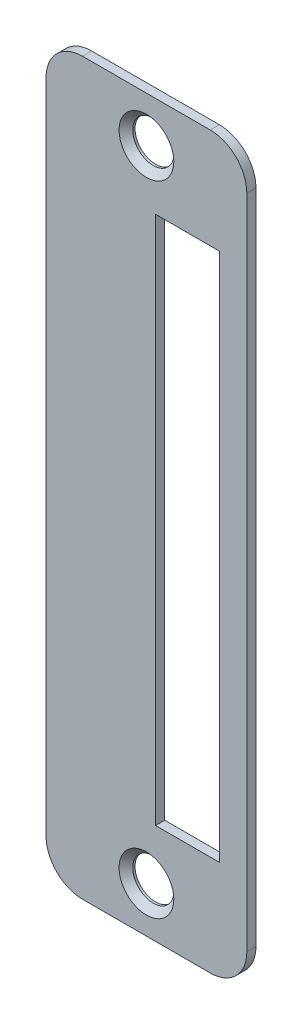
ISO-10303-21;
HEADER;
FILE_DESCRIPTION(('STEP AP214'),'2;1');
FILE_NAME('part.step','',(''),(''),'','','');
FILE_SCHEMA(('AUTOMOTIVE_DESIGN { 1 0 10303 214 1 1 1 1 }'));
ENDSEC;
DATA;
#1=APPLICATION_CONTEXT('core data for automotive mechanical design processes');
#2=APPLICATION_PROTOCOL_DEFINITION('international standard','automotive_design',2000,#1);
#3=PRODUCT_CONTEXT('',#1,'mechanical');
#4=PRODUCT('Part','Part','',(#3));
#5=PRODUCT_RELATED_PRODUCT_CATEGORY('part','',(#4));
#6=PRODUCT_DEFINITION_FORMATION('','',#4);
#7=PRODUCT_DEFINITION_CONTEXT('part definition',#1,'design');
#8=PRODUCT_DEFINITION('design','',#6,#7);
#9=PRODUCT_DEFINITION_SHAPE('','',#8);
#10=(LENGTH_UNIT() NAMED_UNIT(*) SI_UNIT(.MILLI.,.METRE.));
#11=(NAMED_UNIT(*) PLANE_ANGLE_UNIT() SI_UNIT($,.RADIAN.));
#12=(NAMED_UNIT(*) SI_UNIT($,.STERADIAN.) SOLID_ANGLE_UNIT());
#13=UNCERTAINTY_MEASURE_WITH_UNIT(LENGTH_MEASURE(1.E-05),#10,'distance_accuracy_value','');
#14=(GEOMETRIC_REPRESENTATION_CONTEXT(3) GLOBAL_UNCERTAINTY_ASSIGNED_CONTEXT((#13)) GLOBAL_UNIT_ASSIGNED_CONTEXT((#10,
#11,#12)) REPRESENTATION_CONTEXT('',''));
#15=CARTESIAN_POINT('',(0.,0.,0.));
#16=DIRECTION('',(0.,0.,1.));
#17=DIRECTION('',(1.,0.,0.));
#18=AXIS2_PLACEMENT_3D('',#15,#16,#17);
#19=CARTESIAN_POINT('',(-7.,-36.,1.));
#20=DIRECTION('',(0.,0.,-1.));
#21=DIRECTION('',(-1.,0.,0.));
#22=AXIS2_PLACEMENT_3D('',#19,#20,#21);
#23=PLANE('',#22);
#24=CARTESIAN_POINT('',(0.,-35.,1.));
#25=DIRECTION('',(0.,0.,1.));
#26=DIRECTION('',(1.,0.,0.));
#27=AXIS2_PLACEMENT_3D('',#24,#25,#26);
#28=CIRCLE('',#27,3.);
#29=CARTESIAN_POINT('',(3.00000000000001,-35.,1.));
#30=VERTEX_POINT('',#29);
#31=EDGE_CURVE('E319',#30,#30,#28,.T.);
#32=ORIENTED_EDGE('',*,*,#31,.F.);
#33=EDGE_LOOP('',(#32));
#34=FACE_BOUND('',#33,.T.);
#35=CARTESIAN_POINT('',(-7.,-36.,1.));
#36=DIRECTION('',(0.,0.,1.));
#37=DIRECTION('',(-1.,0.,0.));
#38=AXIS2_PLACEMENT_3D('',#35,#36,#37);
#39=CIRCLE('',#38,4.);
#40=CARTESIAN_POINT('',(-11.,-36.,1.));
#41=VERTEX_POINT('',#40);
#42=CARTESIAN_POINT('',(-6.99999999999997,-40.,1.));
#43=VERTEX_POINT('',#42);
#44=EDGE_CURVE('E160',#41,#43,#39,.T.);
#45=ORIENTED_EDGE('',*,*,#44,.T.);
#46=DIRECTION('',(1.,0.,0.));
#47=VECTOR('',#46,1.);
#48=CARTESIAN_POINT('',(-6.99999999999997,-40.,1.));
#49=LINE('',#48,#47);
#50=CARTESIAN_POINT('',(6.99999999999997,-40.,1.));
#51=VERTEX_POINT('',#50);
#52=EDGE_CURVE('E163',#43,#51,#49,.T.);
#53=ORIENTED_EDGE('',*,*,#52,.T.);
#54=CARTESIAN_POINT('',(7.,-36.,1.));
#55=DIRECTION('',(0.,0.,1.));
#56=DIRECTION('',(-1.,0.,0.));
#57=AXIS2_PLACEMENT_3D('',#54,#55,#56);
#58=CIRCLE('',#57,4.);
#59=CARTESIAN_POINT('',(11.,-36.,1.));
#60=VERTEX_POINT('',#59);
#61=EDGE_CURVE('E166',#51,#60,#58,.T.);
#62=ORIENTED_EDGE('',*,*,#61,.T.);
#63=DIRECTION('',(0.,1.,0.));
#64=VECTOR('',#63,1.);
#65=CARTESIAN_POINT('',(11.,-36.,1.));
#66=LINE('',#65,#64);
#67=CARTESIAN_POINT('',(11.,36.,1.));
#68=VERTEX_POINT('',#67);
#69=EDGE_CURVE('E168',#60,#68,#66,.T.);
#70=ORIENTED_EDGE('',*,*,#69,.T.);
#71=CARTESIAN_POINT('',(7.,36.,1.));
#72=DIRECTION('',(0.,0.,1.));
#73=DIRECTION('',(1.,0.,0.));
#74=AXIS2_PLACEMENT_3D('',#71,#72,#73);
#75=CIRCLE('',#74,4.);
#76=CARTESIAN_POINT('',(6.99999999999997,40.,1.));
#77=VERTEX_POINT('',#76);
#78=EDGE_CURVE('E170',#68,#77,#75,.T.);
#79=ORIENTED_EDGE('',*,*,#78,.T.);
#80=DIRECTION('',(-1.,0.,0.));
#81=VECTOR('',#80,1.);
#82=CARTESIAN_POINT('',(6.99999999999997,40.,1.));
#83=LINE('',#82,#81);
#84=CARTESIAN_POINT('',(-6.99999999999997,40.,1.));
#85=VERTEX_POINT('',#84);
#86=EDGE_CURVE('E172',#77,#85,#83,.T.);
#87=ORIENTED_EDGE('',*,*,#86,.T.);
#88=CARTESIAN_POINT('',(-7.,36.,1.));
#89=DIRECTION('',(0.,0.,1.));
#90=DIRECTION('',(1.,0.,0.));
#91=AXIS2_PLACEMENT_3D('',#88,#89,#90);
#92=CIRCLE('',#91,4.);
#93=CARTESIAN_POINT('',(-11.,36.,1.));
#94=VERTEX_POINT('',#93);
#95=EDGE_CURVE('E174',#85,#94,#92,.T.);
#96=ORIENTED_EDGE('',*,*,#95,.T.);
#97=DIRECTION('',(0.,-1.,0.));
#98=VECTOR('',#97,1.);
#99=CARTESIAN_POINT('',(-11.,36.,1.));
#100=LINE('',#99,#98);
#101=EDGE_CURVE('E176',#94,#41,#100,.T.);
#102=ORIENTED_EDGE('',*,*,#101,.T.);
#103=EDGE_LOOP('',(#45,#53,#62,#70,#79,#87,#96,#102));
#104=FACE_BOUND('',#103,.T.);
#105=DIRECTION('',(-1.,0.,0.));
#106=VECTOR('',#105,1.);
#107=CARTESIAN_POINT('',(8.00000000000001,29.,1.));
#108=LINE('',#107,#106);
#109=CARTESIAN_POINT('',(8.00000000000001,29.,1.));
#110=VERTEX_POINT('',#109);
#111=CARTESIAN_POINT('',(1.00000000000001,29.,1.));
#112=VERTEX_POINT('',#111);
#113=EDGE_CURVE('E121',#110,#112,#108,.T.);
#114=ORIENTED_EDGE('',*,*,#113,.F.);
#115=DIRECTION('',(0.,1.,0.));
#116=VECTOR('',#115,1.);
#117=CARTESIAN_POINT('',(8.00000000000001,-29.,1.));
#118=LINE('',#117,#116);
#119=CARTESIAN_POINT('',(8.00000000000001,-29.,1.));
#120=VERTEX_POINT('',#119);
#121=EDGE_CURVE('E144',#120,#110,#118,.T.);
#122=ORIENTED_EDGE('',*,*,#121,.F.);
#123=DIRECTION('',(1.,0.,0.));
#124=VECTOR('',#123,1.);
#125=CARTESIAN_POINT('',(8.00000000000001,-29.,1.));
#126=LINE('',#125,#124);
#127=CARTESIAN_POINT('',(1.00000000000002,-29.,1.));
#128=VERTEX_POINT('',#127);
#129=EDGE_CURVE('E142',#128,#120,#126,.T.);
#130=ORIENTED_EDGE('',*,*,#129,.F.);
#131=DIRECTION('',(0.,-1.,0.));
#132=VECTOR('',#131,1.);
#133=CARTESIAN_POINT('',(1.00000000000001,29.,1.));
#134=LINE('',#133,#132);
#135=EDGE_CURVE('E129',#112,#128,#134,.T.);
#136=ORIENTED_EDGE('',*,*,#135,.F.);
#137=EDGE_LOOP('',(#114,#122,#130,#136));
#138=FACE_BOUND('',#137,.T.);
#139=CARTESIAN_POINT('',(0.,35.,1.));
#140=DIRECTION('',(0.,0.,1.));
#141=DIRECTION('',(1.,0.,0.));
#142=AXIS2_PLACEMENT_3D('',#139,#140,#141);
#143=CIRCLE('',#142,3.);
#144=CARTESIAN_POINT('',(3.,35.,1.));
#145=VERTEX_POINT('',#144);
#146=EDGE_CURVE('E312',#145,#145,#143,.T.);
#147=ORIENTED_EDGE('',*,*,#146,.F.);
#148=EDGE_LOOP('',(#147));
#149=FACE_BOUND('',#148,.T.);
#150=ADVANCED_FACE('F32',(#34,#104,#138,#149),#23,.F.);
#151=CARTESIAN_POINT('',(-7.,-36.,0.));
#152=DIRECTION('',(0.,0.,-1.));
#153=DIRECTION('',(-1.,0.,0.));
#154=AXIS2_PLACEMENT_3D('',#151,#152,#153);
#155=PLANE('',#154);
#156=CARTESIAN_POINT('',(0.,35.,0.));
#157=DIRECTION('',(0.,0.,1.));
#158=DIRECTION('',(1.,0.,0.));
#159=AXIS2_PLACEMENT_3D('',#156,#157,#158);
#160=CIRCLE('',#159,2.25);
#161=CARTESIAN_POINT('',(2.25,35.,0.));
#162=VERTEX_POINT('',#161);
#163=EDGE_CURVE('E314',#162,#162,#160,.T.);
#164=ORIENTED_EDGE('',*,*,#163,.T.);
#165=EDGE_LOOP('',(#164));
#166=FACE_BOUND('',#165,.T.);
#167=DIRECTION('',(0.,1.,0.));
#168=VECTOR('',#167,1.);
#169=CARTESIAN_POINT('',(8.00000000000001,-29.,0.));
#170=LINE('',#169,#168);
#171=CARTESIAN_POINT('',(8.00000000000001,-29.,0.));
#172=VERTEX_POINT('',#171);
#173=CARTESIAN_POINT('',(8.00000000000001,29.,0.));
#174=VERTEX_POINT('',#173);
#175=EDGE_CURVE('E130',#172,#174,#170,.T.);
#176=ORIENTED_EDGE('',*,*,#175,.T.);
#177=DIRECTION('',(-1.,0.,0.));
#178=VECTOR('',#177,1.);
#179=CARTESIAN_POINT('',(8.00000000000001,29.,0.));
#180=LINE('',#179,#178);
#181=CARTESIAN_POINT('',(1.00000000000001,29.,0.));
#182=VERTEX_POINT('',#181);
#183=EDGE_CURVE('E55',#174,#182,#180,.T.);
#184=ORIENTED_EDGE('',*,*,#183,.T.);
#185=DIRECTION('',(0.,-1.,0.));
#186=VECTOR('',#185,1.);
#187=CARTESIAN_POINT('',(1.00000000000001,29.,0.));
#188=LINE('',#187,#186);
#189=CARTESIAN_POINT('',(1.00000000000002,-29.,0.));
#190=VERTEX_POINT('',#189);
#191=EDGE_CURVE('E136',#182,#190,#188,.T.);
#192=ORIENTED_EDGE('',*,*,#191,.T.);
#193=DIRECTION('',(1.,0.,0.));
#194=VECTOR('',#193,1.);
#195=CARTESIAN_POINT('',(8.00000000000001,-29.,0.));
#196=LINE('',#195,#194);
#197=EDGE_CURVE('E152',#190,#172,#196,.T.);
#198=ORIENTED_EDGE('',*,*,#197,.T.);
#199=EDGE_LOOP('',(#176,#184,#192,#198));
#200=FACE_BOUND('',#199,.T.);
#201=CARTESIAN_POINT('',(-7.,-36.,0.));
#202=DIRECTION('',(0.,0.,1.));
#203=DIRECTION('',(-1.,0.,0.));
#204=AXIS2_PLACEMENT_3D('',#201,#202,#203);
#205=CIRCLE('',#204,4.);
#206=CARTESIAN_POINT('',(-11.,-36.,0.));
#207=VERTEX_POINT('',#206);
#208=CARTESIAN_POINT('',(-6.99999999999997,-40.,0.));
#209=VERTEX_POINT('',#208);
#210=EDGE_CURVE('E137',#207,#209,#205,.T.);
#211=ORIENTED_EDGE('',*,*,#210,.F.);
#212=DIRECTION('',(0.,-1.,0.));
#213=VECTOR('',#212,1.);
#214=CARTESIAN_POINT('',(-11.,36.,0.));
#215=LINE('',#214,#213);
#216=CARTESIAN_POINT('',(-11.,36.,0.));
#217=VERTEX_POINT('',#216);
#218=EDGE_CURVE('E164',#217,#207,#215,.T.);
#219=ORIENTED_EDGE('',*,*,#218,.F.);
#220=CARTESIAN_POINT('',(-7.,36.,0.));
#221=DIRECTION('',(0.,0.,1.));
#222=DIRECTION('',(1.,0.,0.));
#223=AXIS2_PLACEMENT_3D('',#220,#221,#222);
#224=CIRCLE('',#223,4.);
#225=CARTESIAN_POINT('',(-6.99999999999997,40.,0.));
#226=VERTEX_POINT('',#225);
#227=EDGE_CURVE('E191',#226,#217,#224,.T.);
#228=ORIENTED_EDGE('',*,*,#227,.F.);
#229=DIRECTION('',(-1.,0.,0.));
#230=VECTOR('',#229,1.);
#231=CARTESIAN_POINT('',(6.99999999999997,40.,0.));
#232=LINE('',#231,#230);
#233=CARTESIAN_POINT('',(6.99999999999997,40.,0.));
#234=VERTEX_POINT('',#233);
#235=EDGE_CURVE('E189',#234,#226,#232,.T.);
#236=ORIENTED_EDGE('',*,*,#235,.F.);
#237=CARTESIAN_POINT('',(7.,36.,0.));
#238=DIRECTION('',(0.,0.,1.));
#239=DIRECTION('',(1.,0.,0.));
#240=AXIS2_PLACEMENT_3D('',#237,#238,#239);
#241=CIRCLE('',#240,4.);
#242=CARTESIAN_POINT('',(11.,36.,0.));
#243=VERTEX_POINT('',#242);
#244=EDGE_CURVE('E187',#243,#234,#241,.T.);
#245=ORIENTED_EDGE('',*,*,#244,.F.);
#246=DIRECTION('',(0.,1.,0.));
#247=VECTOR('',#246,1.);
#248=CARTESIAN_POINT('',(11.,-36.,0.));
#249=LINE('',#248,#247);
#250=CARTESIAN_POINT('',(11.,-36.,0.));
#251=VERTEX_POINT('',#250);
#252=EDGE_CURVE('E185',#251,#243,#249,.T.);
#253=ORIENTED_EDGE('',*,*,#252,.F.);
#254=CARTESIAN_POINT('',(7.,-36.,0.));
#255=DIRECTION('',(0.,0.,1.));
#256=DIRECTION('',(-1.,0.,0.));
#257=AXIS2_PLACEMENT_3D('',#254,#255,#256);
#258=CIRCLE('',#257,4.);
#259=CARTESIAN_POINT('',(6.99999999999997,-40.,0.));
#260=VERTEX_POINT('',#259);
#261=EDGE_CURVE('E183',#260,#251,#258,.T.);
#262=ORIENTED_EDGE('',*,*,#261,.F.);
#263=DIRECTION('',(1.,0.,0.));
#264=VECTOR('',#263,1.);
#265=CARTESIAN_POINT('',(-6.99999999999997,-40.,0.));
#266=LINE('',#265,#264);
#267=EDGE_CURVE('E181',#209,#260,#266,.T.);
#268=ORIENTED_EDGE('',*,*,#267,.F.);
#269=EDGE_LOOP('',(#211,#219,#228,#236,#245,#253,#262,#268));
#270=FACE_BOUND('',#269,.T.);
#271=CARTESIAN_POINT('',(0.,-35.,0.));
#272=DIRECTION('',(0.,0.,1.));
#273=DIRECTION('',(1.,0.,0.));
#274=AXIS2_PLACEMENT_3D('',#271,#272,#273);
#275=CIRCLE('',#274,2.25);
#276=CARTESIAN_POINT('',(2.25000000000001,-35.,0.));
#277=VERTEX_POINT('',#276);
#278=EDGE_CURVE('E150',#277,#277,#275,.T.);
#279=ORIENTED_EDGE('',*,*,#278,.T.);
#280=EDGE_LOOP('',(#279));
#281=FACE_BOUND('',#280,.T.);
#282=ADVANCED_FACE('F221',(#166,#200,#270,#281),#155,.T.);
#283=CARTESIAN_POINT('',(-7.,-36.,1.));
#284=DIRECTION('',(0.,0.,-1.));
#285=DIRECTION('',(-1.,0.,0.));
#286=AXIS2_PLACEMENT_3D('',#283,#284,#285);
#287=CYLINDRICAL_SURFACE('',#286,4.);
#288=ORIENTED_EDGE('',*,*,#210,.T.);
#289=DIRECTION('',(0.,0.,-1.));
#290=VECTOR('',#289,1.);
#291=CARTESIAN_POINT('',(-6.99999999999997,-40.,1.));
#292=LINE('',#291,#290);
#293=EDGE_CURVE('E11',#43,#209,#292,.T.);
#294=ORIENTED_EDGE('',*,*,#293,.F.);
#295=ORIENTED_EDGE('',*,*,#44,.F.);
#296=DIRECTION('',(0.,0.,-1.));
#297=VECTOR('',#296,1.);
#298=CARTESIAN_POINT('',(-11.,-36.,1.));
#299=LINE('',#298,#297);
#300=EDGE_CURVE('E178',#41,#207,#299,.T.);
#301=ORIENTED_EDGE('',*,*,#300,.T.);
#302=EDGE_LOOP('',(#288,#294,#295,#301));
#303=FACE_BOUND('',#302,.T.);
#304=ADVANCED_FACE('F34',(#303),#287,.T.);
#305=CARTESIAN_POINT('',(-6.99999999999997,-40.,1.));
#306=DIRECTION('',(0.,1.,0.));
#307=DIRECTION('',(0.,0.,1.));
#308=AXIS2_PLACEMENT_3D('',#305,#306,#307);
#309=PLANE('',#308);
#310=ORIENTED_EDGE('',*,*,#267,.T.);
#311=DIRECTION('',(0.,0.,-1.));
#312=VECTOR('',#311,1.);
#313=CARTESIAN_POINT('',(6.99999999999997,-40.,1.));
#314=LINE('',#313,#312);
#315=EDGE_CURVE('E40',#51,#260,#314,.T.);
#316=ORIENTED_EDGE('',*,*,#315,.F.);
#317=ORIENTED_EDGE('',*,*,#52,.F.);
#318=ORIENTED_EDGE('',*,*,#293,.T.);
#319=EDGE_LOOP('',(#310,#316,#317,#318));
#320=FACE_BOUND('',#319,.T.);
#321=ADVANCED_FACE('F238',(#320),#309,.F.);
#322=CARTESIAN_POINT('',(7.,-36.,1.));
#323=DIRECTION('',(0.,0.,-1.));
#324=DIRECTION('',(-1.,0.,0.));
#325=AXIS2_PLACEMENT_3D('',#322,#323,#324);
#326=CYLINDRICAL_SURFACE('',#325,4.);
#327=ORIENTED_EDGE('',*,*,#261,.T.);
#328=DIRECTION('',(0.,0.,-1.));
#329=VECTOR('',#328,1.);
#330=CARTESIAN_POINT('',(11.,-36.,1.));
#331=LINE('',#330,#329);
#332=EDGE_CURVE('E208',#60,#251,#331,.T.);
#333=ORIENTED_EDGE('',*,*,#332,.F.);
#334=ORIENTED_EDGE('',*,*,#61,.F.);
#335=ORIENTED_EDGE('',*,*,#315,.T.);
#336=EDGE_LOOP('',(#327,#333,#334,#335));
#337=FACE_BOUND('',#336,.T.);
#338=ADVANCED_FACE('F215',(#337),#326,.T.);
#339=CARTESIAN_POINT('',(11.,-36.,1.));
#340=DIRECTION('',(-1.,0.,0.));
#341=DIRECTION('',(0.,0.,1.));
#342=AXIS2_PLACEMENT_3D('',#339,#340,#341);
#343=PLANE('',#342);
#344=ORIENTED_EDGE('',*,*,#252,.T.);
#345=DIRECTION('',(0.,0.,-1.));
#346=VECTOR('',#345,1.);
#347=CARTESIAN_POINT('',(11.,36.,1.));
#348=LINE('',#347,#346);
#349=EDGE_CURVE('E205',#68,#243,#348,.T.);
#350=ORIENTED_EDGE('',*,*,#349,.F.);
#351=ORIENTED_EDGE('',*,*,#69,.F.);
#352=ORIENTED_EDGE('',*,*,#332,.T.);
#353=EDGE_LOOP('',(#344,#350,#351,#352));
#354=FACE_BOUND('',#353,.T.);
#355=ADVANCED_FACE('F227',(#354),#343,.F.);
#356=CARTESIAN_POINT('',(7.,36.,1.));
#357=DIRECTION('',(0.,0.,-1.));
#358=DIRECTION('',(-1.,0.,0.));
#359=AXIS2_PLACEMENT_3D('',#356,#357,#358);
#360=CYLINDRICAL_SURFACE('',#359,4.);
#361=ORIENTED_EDGE('',*,*,#244,.T.);
#362=DIRECTION('',(0.,0.,-1.));
#363=VECTOR('',#362,1.);
#364=CARTESIAN_POINT('',(6.99999999999997,40.,1.));
#365=LINE('',#364,#363);
#366=EDGE_CURVE('E202',#77,#234,#365,.T.);
#367=ORIENTED_EDGE('',*,*,#366,.F.);
#368=ORIENTED_EDGE('',*,*,#78,.F.);
#369=ORIENTED_EDGE('',*,*,#349,.T.);
#370=EDGE_LOOP('',(#361,#367,#368,#369));
#371=FACE_BOUND('',#370,.T.);
#372=ADVANCED_FACE('F231',(#371),#360,.T.);
#373=CARTESIAN_POINT('',(6.99999999999997,40.,1.));
#374=DIRECTION('',(0.,-1.,0.));
#375=DIRECTION('',(0.,0.,-1.));
#376=AXIS2_PLACEMENT_3D('',#373,#374,#375);
#377=PLANE('',#376);
#378=ORIENTED_EDGE('',*,*,#235,.T.);
#379=DIRECTION('',(0.,0.,-1.));
#380=VECTOR('',#379,1.);
#381=CARTESIAN_POINT('',(-6.99999999999997,40.,1.));
#382=LINE('',#381,#380);
#383=EDGE_CURVE('E199',#85,#226,#382,.T.);
#384=ORIENTED_EDGE('',*,*,#383,.F.);
#385=ORIENTED_EDGE('',*,*,#86,.F.);
#386=ORIENTED_EDGE('',*,*,#366,.T.);
#387=EDGE_LOOP('',(#378,#384,#385,#386));
#388=FACE_BOUND('',#387,.T.);
#389=ADVANCED_FACE('F251',(#388),#377,.F.);
#390=CARTESIAN_POINT('',(-7.,36.,1.));
#391=DIRECTION('',(0.,0.,-1.));
#392=DIRECTION('',(-1.,0.,0.));
#393=AXIS2_PLACEMENT_3D('',#390,#391,#392);
#394=CYLINDRICAL_SURFACE('',#393,4.);
#395=ORIENTED_EDGE('',*,*,#227,.T.);
#396=DIRECTION('',(0.,0.,-1.));
#397=VECTOR('',#396,1.);
#398=CARTESIAN_POINT('',(-11.,36.,1.));
#399=LINE('',#398,#397);
#400=EDGE_CURVE('E196',#94,#217,#399,.T.);
#401=ORIENTED_EDGE('',*,*,#400,.F.);
#402=ORIENTED_EDGE('',*,*,#95,.F.);
#403=ORIENTED_EDGE('',*,*,#383,.T.);
#404=EDGE_LOOP('',(#395,#401,#402,#403));
#405=FACE_BOUND('',#404,.T.);
#406=ADVANCED_FACE('F249',(#405),#394,.T.);
#407=CARTESIAN_POINT('',(-11.,36.,1.));
#408=DIRECTION('',(1.,0.,0.));
#409=DIRECTION('',(0.,0.,-1.));
#410=AXIS2_PLACEMENT_3D('',#407,#408,#409);
#411=PLANE('',#410);
#412=ORIENTED_EDGE('',*,*,#218,.T.);
#413=ORIENTED_EDGE('',*,*,#300,.F.);
#414=ORIENTED_EDGE('',*,*,#101,.F.);
#415=ORIENTED_EDGE('',*,*,#400,.T.);
#416=EDGE_LOOP('',(#412,#413,#414,#415));
#417=FACE_BOUND('',#416,.T.);
#418=ADVANCED_FACE('F244',(#417),#411,.F.);
#419=CARTESIAN_POINT('',(8.00000000000001,29.,1.));
#420=DIRECTION('',(0.,-1.,0.));
#421=DIRECTION('',(0.,0.,-1.));
#422=AXIS2_PLACEMENT_3D('',#419,#420,#421);
#423=PLANE('',#422);
#424=ORIENTED_EDGE('',*,*,#183,.F.);
#425=DIRECTION('',(0.,0.,-1.));
#426=VECTOR('',#425,1.);
#427=CARTESIAN_POINT('',(8.00000000000001,29.,1.));
#428=LINE('',#427,#426);
#429=EDGE_CURVE('E125',#110,#174,#428,.T.);
#430=ORIENTED_EDGE('',*,*,#429,.F.);
#431=ORIENTED_EDGE('',*,*,#113,.T.);
#432=DIRECTION('',(0.,0.,-1.));
#433=VECTOR('',#432,1.);
#434=CARTESIAN_POINT('',(1.00000000000001,29.,1.));
#435=LINE('',#434,#433);
#436=EDGE_CURVE('E124',#112,#182,#435,.T.);
#437=ORIENTED_EDGE('',*,*,#436,.T.);
#438=EDGE_LOOP('',(#424,#430,#431,#437));
#439=FACE_BOUND('',#438,.T.);
#440=ADVANCED_FACE('F123',(#439),#423,.T.);
#441=CARTESIAN_POINT('',(1.00000000000001,29.,1.));
#442=DIRECTION('',(1.,0.,0.));
#443=DIRECTION('',(0.,1.,0.));
#444=AXIS2_PLACEMENT_3D('',#441,#442,#443);
#445=PLANE('',#444);
#446=ORIENTED_EDGE('',*,*,#191,.F.);
#447=ORIENTED_EDGE('',*,*,#436,.F.);
#448=ORIENTED_EDGE('',*,*,#135,.T.);
#449=DIRECTION('',(0.,0.,-1.));
#450=VECTOR('',#449,1.);
#451=CARTESIAN_POINT('',(1.00000000000002,-29.,1.));
#452=LINE('',#451,#450);
#453=EDGE_CURVE('E138',#128,#190,#452,.T.);
#454=ORIENTED_EDGE('',*,*,#453,.T.);
#455=EDGE_LOOP('',(#446,#447,#448,#454));
#456=FACE_BOUND('',#455,.T.);
#457=ADVANCED_FACE('F133',(#456),#445,.T.);
#458=CARTESIAN_POINT('',(8.00000000000001,-29.,1.));
#459=DIRECTION('',(0.,1.,0.));
#460=DIRECTION('',(0.,0.,1.));
#461=AXIS2_PLACEMENT_3D('',#458,#459,#460);
#462=PLANE('',#461);
#463=ORIENTED_EDGE('',*,*,#197,.F.);
#464=ORIENTED_EDGE('',*,*,#453,.F.);
#465=ORIENTED_EDGE('',*,*,#129,.T.);
#466=DIRECTION('',(0.,0.,-1.));
#467=VECTOR('',#466,1.);
#468=CARTESIAN_POINT('',(8.00000000000001,-29.,1.));
#469=LINE('',#468,#467);
#470=EDGE_CURVE('E47',#120,#172,#469,.T.);
#471=ORIENTED_EDGE('',*,*,#470,.T.);
#472=EDGE_LOOP('',(#463,#464,#465,#471));
#473=FACE_BOUND('',#472,.T.);
#474=ADVANCED_FACE('F279',(#473),#462,.T.);
#475=CARTESIAN_POINT('',(8.00000000000001,-29.,1.));
#476=DIRECTION('',(-1.,0.,0.));
#477=DIRECTION('',(0.,0.,1.));
#478=AXIS2_PLACEMENT_3D('',#475,#476,#477);
#479=PLANE('',#478);
#480=ORIENTED_EDGE('',*,*,#175,.F.);
#481=ORIENTED_EDGE('',*,*,#470,.F.);
#482=ORIENTED_EDGE('',*,*,#121,.T.);
#483=ORIENTED_EDGE('',*,*,#429,.T.);
#484=EDGE_LOOP('',(#480,#481,#482,#483));
#485=FACE_BOUND('',#484,.T.);
#486=ADVANCED_FACE('F283',(#485),#479,.T.);
#487=CARTESIAN_POINT('',(0.,-35.,1.));
#488=DIRECTION('',(0.,0.,1.));
#489=DIRECTION('',(1.,0.,0.));
#490=AXIS2_PLACEMENT_3D('',#487,#488,#489);
#491=CYLINDRICAL_SURFACE('',#490,2.25);
#492=ORIENTED_EDGE('',*,*,#278,.F.);
#493=EDGE_LOOP('',(#492));
#494=FACE_BOUND('',#493,.T.);
#495=CARTESIAN_POINT('',(0.,-35.,0.25));
#496=DIRECTION('',(0.,0.,1.));
#497=DIRECTION('',(1.,0.,0.));
#498=AXIS2_PLACEMENT_3D('',#495,#496,#497);
#499=CIRCLE('',#498,2.25);
#500=CARTESIAN_POINT('',(2.25000000000001,-35.,0.25));
#501=VERTEX_POINT('',#500);
#502=EDGE_CURVE('E322',#501,#501,#499,.T.);
#503=ORIENTED_EDGE('',*,*,#502,.T.);
#504=EDGE_LOOP('',(#503));
#505=FACE_BOUND('',#504,.T.);
#506=ADVANCED_FACE('F289',(#494,#505),#491,.F.);
#507=CARTESIAN_POINT('',(0.,-35.,1.));
#508=DIRECTION('',(0.,0.,1.));
#509=DIRECTION('',(1.,0.,0.));
#510=AXIS2_PLACEMENT_3D('',#507,#508,#509);
#511=CONICAL_SURFACE('',#510,3.,0.785398163397449);
#512=ORIENTED_EDGE('',*,*,#502,.F.);
#513=EDGE_LOOP('',(#512));
#514=FACE_BOUND('',#513,.T.);
#515=ORIENTED_EDGE('',*,*,#31,.T.);
#516=EDGE_LOOP('',(#515));
#517=FACE_BOUND('',#516,.T.);
#518=ADVANCED_FACE('F292',(#514,#517),#511,.F.);
#519=CARTESIAN_POINT('',(0.,35.,1.));
#520=DIRECTION('',(0.,0.,1.));
#521=DIRECTION('',(1.,0.,0.));
#522=AXIS2_PLACEMENT_3D('',#519,#520,#521);
#523=CYLINDRICAL_SURFACE('',#522,2.25);
#524=ORIENTED_EDGE('',*,*,#163,.F.);
#525=EDGE_LOOP('',(#524));
#526=FACE_BOUND('',#525,.T.);
#527=CARTESIAN_POINT('',(0.,35.,0.25));
#528=DIRECTION('',(0.,0.,1.));
#529=DIRECTION('',(1.,0.,0.));
#530=AXIS2_PLACEMENT_3D('',#527,#528,#529);
#531=CIRCLE('',#530,2.25);
#532=CARTESIAN_POINT('',(2.25,35.,0.25));
#533=VERTEX_POINT('',#532);
#534=EDGE_CURVE('E309',#533,#533,#531,.T.);
#535=ORIENTED_EDGE('',*,*,#534,.T.);
#536=EDGE_LOOP('',(#535));
#537=FACE_BOUND('',#536,.T.);
#538=ADVANCED_FACE('F296',(#526,#537),#523,.F.);
#539=CARTESIAN_POINT('',(0.,35.,1.));
#540=DIRECTION('',(0.,0.,1.));
#541=DIRECTION('',(1.,0.,0.));
#542=AXIS2_PLACEMENT_3D('',#539,#540,#541);
#543=CONICAL_SURFACE('',#542,3.,0.785398163397449);
#544=ORIENTED_EDGE('',*,*,#534,.F.);
#545=EDGE_LOOP('',(#544));
#546=FACE_BOUND('',#545,.T.);
#547=ORIENTED_EDGE('',*,*,#146,.T.);
#548=EDGE_LOOP('',(#547));
#549=FACE_BOUND('',#548,.T.);
#550=ADVANCED_FACE('F300',(#546,#549),#543,.F.);
#551=CLOSED_SHELL('',(#150,#282,#304,#321,#338,#355,#372,#389,#406,#418,#440,#457,#474,#486,
#506,#518,#538,#550));
#552=MANIFOLD_SOLID_BREP('B2',#551);
#553=ADVANCED_BREP_SHAPE_REPRESENTATION('',(#18,#552),#14);
#554=SHAPE_DEFINITION_REPRESENTATION(#9,#553);
ENDSEC;
END-ISO-10303-21;
